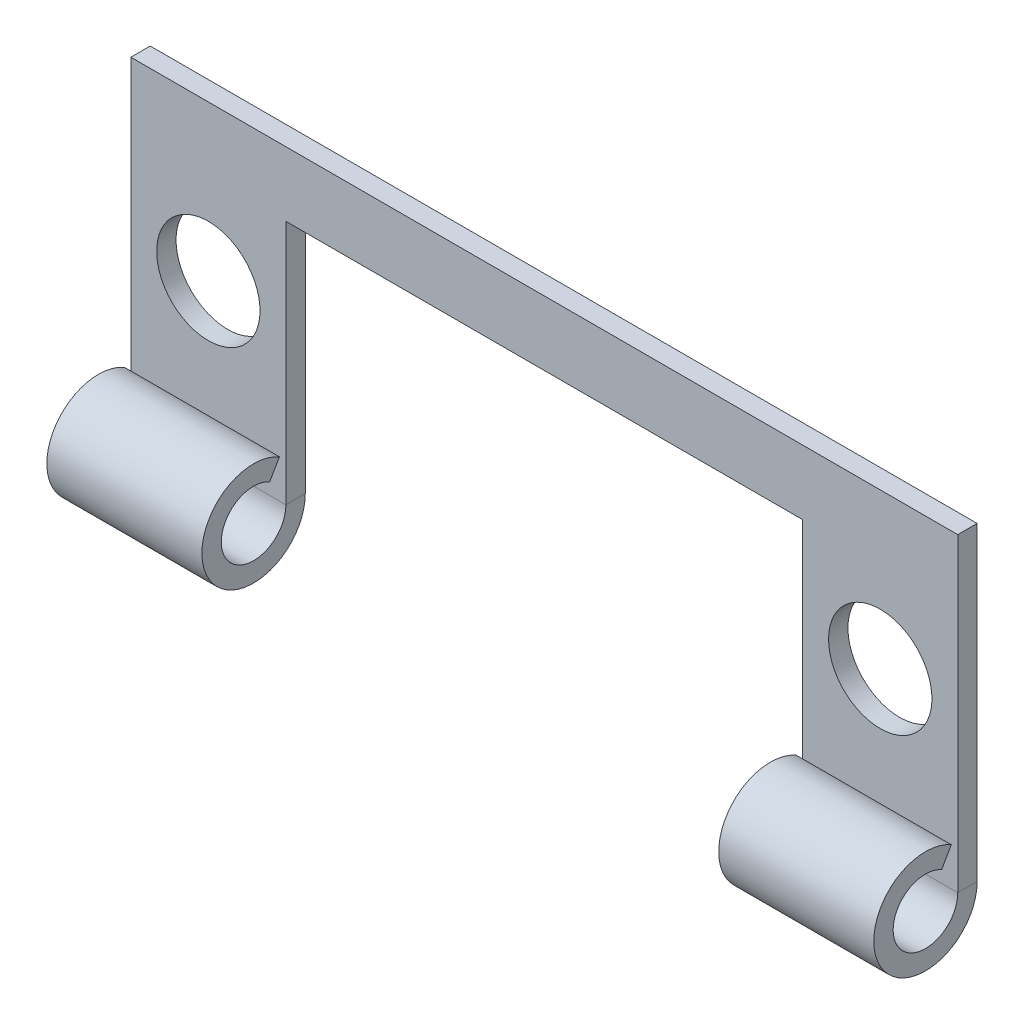
ISO-10303-21;
HEADER;
FILE_DESCRIPTION(('STEP AP214'),'2;1');
FILE_NAME('part.step','',(''),(''),'','','');
FILE_SCHEMA(('AUTOMOTIVE_DESIGN { 1 0 10303 214 1 1 1 1 }'));
ENDSEC;
DATA;
#1=APPLICATION_CONTEXT('core data for automotive mechanical design processes');
#2=APPLICATION_PROTOCOL_DEFINITION('international standard','automotive_design',2000,#1);
#3=PRODUCT_CONTEXT('',#1,'mechanical');
#4=PRODUCT('Part','Part','',(#3));
#5=PRODUCT_RELATED_PRODUCT_CATEGORY('part','',(#4));
#6=PRODUCT_DEFINITION_FORMATION('','',#4);
#7=PRODUCT_DEFINITION_CONTEXT('part definition',#1,'design');
#8=PRODUCT_DEFINITION('design','',#6,#7);
#9=PRODUCT_DEFINITION_SHAPE('','',#8);
#10=(LENGTH_UNIT() NAMED_UNIT(*) SI_UNIT(.MILLI.,.METRE.));
#11=(NAMED_UNIT(*) PLANE_ANGLE_UNIT() SI_UNIT($,.RADIAN.));
#12=(NAMED_UNIT(*) SI_UNIT($,.STERADIAN.) SOLID_ANGLE_UNIT());
#13=UNCERTAINTY_MEASURE_WITH_UNIT(LENGTH_MEASURE(1.E-05),#10,'distance_accuracy_value','');
#14=(GEOMETRIC_REPRESENTATION_CONTEXT(3) GLOBAL_UNCERTAINTY_ASSIGNED_CONTEXT((#13)) GLOBAL_UNIT_ASSIGNED_CONTEXT((#10,
#11,#12)) REPRESENTATION_CONTEXT('',''));
#15=CARTESIAN_POINT('',(0.,0.,0.));
#16=DIRECTION('',(0.,0.,1.));
#17=DIRECTION('',(1.,0.,0.));
#18=AXIS2_PLACEMENT_3D('',#15,#16,#17);
#19=CARTESIAN_POINT('',(0.,0.,-1.190625));
#20=DIRECTION('',(0.,0.,-1.));
#21=DIRECTION('',(-1.,0.,0.));
#22=AXIS2_PLACEMENT_3D('',#19,#20,#21);
#23=PLANE('',#22);
#24=CARTESIAN_POINT('',(-20.6375,0.,-1.190625));
#25=DIRECTION('',(0.,0.,1.));
#26=DIRECTION('',(1.,0.,0.));
#27=AXIS2_PLACEMENT_3D('',#24,#25,#26);
#28=CIRCLE('',#27,3.175);
#29=CARTESIAN_POINT('',(-17.4625,0.,-1.190625));
#30=VERTEX_POINT('',#29);
#31=EDGE_CURVE('E207',#30,#30,#28,.T.);
#32=ORIENTED_EDGE('',*,*,#31,.T.);
#33=EDGE_LOOP('',(#32));
#34=FACE_BOUND('',#33,.T.);
#35=CARTESIAN_POINT('',(20.6375,0.,-1.190625));
#36=DIRECTION('',(0.,0.,1.));
#37=DIRECTION('',(-1.,0.,0.));
#38=AXIS2_PLACEMENT_3D('',#35,#36,#37);
#39=CIRCLE('',#38,3.175);
#40=CARTESIAN_POINT('',(17.4625,0.,-1.190625));
#41=VERTEX_POINT('',#40);
#42=EDGE_CURVE('E216',#41,#41,#39,.T.);
#43=ORIENTED_EDGE('',*,*,#42,.T.);
#44=EDGE_LOOP('',(#43));
#45=FACE_BOUND('',#44,.T.);
#46=DIRECTION('',(1.,0.,0.));
#47=VECTOR('',#46,1.);
#48=CARTESIAN_POINT('',(-15.875,5.55625,-1.190625));
#49=LINE('',#48,#47);
#50=CARTESIAN_POINT('',(-15.875,5.55625,-1.190625));
#51=VERTEX_POINT('',#50);
#52=CARTESIAN_POINT('',(15.875,5.55625,-1.190625));
#53=VERTEX_POINT('',#52);
#54=EDGE_CURVE('E176',#51,#53,#49,.T.);
#55=ORIENTED_EDGE('',*,*,#54,.F.);
#56=DIRECTION('',(0.,1.,0.));
#57=VECTOR('',#56,1.);
#58=CARTESIAN_POINT('',(-15.875,-9.525,-1.190625));
#59=LINE('',#58,#57);
#60=CARTESIAN_POINT('',(-15.875,-9.525,-1.190625));
#61=VERTEX_POINT('',#60);
#62=EDGE_CURVE('E168',#61,#51,#59,.T.);
#63=ORIENTED_EDGE('',*,*,#62,.F.);
#64=DIRECTION('',(1.,0.,0.));
#65=VECTOR('',#64,1.);
#66=CARTESIAN_POINT('',(-25.4,-9.525,-1.190625));
#67=LINE('',#66,#65);
#68=CARTESIAN_POINT('',(-25.4,-9.525,-1.190625));
#69=VERTEX_POINT('',#68);
#70=EDGE_CURVE('E130',#69,#61,#67,.T.);
#71=ORIENTED_EDGE('',*,*,#70,.F.);
#72=DIRECTION('',(0.,-1.,0.));
#73=VECTOR('',#72,1.);
#74=CARTESIAN_POINT('',(-25.4,-9.525,-1.190625));
#75=LINE('',#74,#73);
#76=CARTESIAN_POINT('',(-25.4,9.525,-1.190625));
#77=VERTEX_POINT('',#76);
#78=EDGE_CURVE('E149',#77,#69,#75,.T.);
#79=ORIENTED_EDGE('',*,*,#78,.F.);
#80=DIRECTION('',(-1.,0.,0.));
#81=VECTOR('',#80,1.);
#82=CARTESIAN_POINT('',(-25.4,9.525,-1.190625));
#83=LINE('',#82,#81);
#84=CARTESIAN_POINT('',(25.4,9.525,-1.190625));
#85=VERTEX_POINT('',#84);
#86=EDGE_CURVE('E153',#85,#77,#83,.T.);
#87=ORIENTED_EDGE('',*,*,#86,.F.);
#88=DIRECTION('',(0.,1.,0.));
#89=VECTOR('',#88,1.);
#90=CARTESIAN_POINT('',(25.4,-9.525,-1.190625));
#91=LINE('',#90,#89);
#92=CARTESIAN_POINT('',(25.4,-9.525,-1.190625));
#93=VERTEX_POINT('',#92);
#94=EDGE_CURVE('E135',#93,#85,#91,.T.);
#95=ORIENTED_EDGE('',*,*,#94,.F.);
#96=CARTESIAN_POINT('',(15.875,-9.525,-1.190625));
#97=VERTEX_POINT('',#96);
#98=EDGE_CURVE('E141',#97,#93,#67,.T.);
#99=ORIENTED_EDGE('',*,*,#98,.F.);
#100=DIRECTION('',(0.,1.,0.));
#101=VECTOR('',#100,1.);
#102=CARTESIAN_POINT('',(15.875,-9.525,-1.190625));
#103=LINE('',#102,#101);
#104=EDGE_CURVE('E166',#97,#53,#103,.T.);
#105=ORIENTED_EDGE('',*,*,#104,.T.);
#106=EDGE_LOOP('',(#55,#63,#71,#79,#87,#95,#99,#105));
#107=FACE_BOUND('',#106,.T.);
#108=ADVANCED_FACE('F41',(#34,#45,#107),#23,.T.);
#109=CARTESIAN_POINT('',(0.,0.,0.));
#110=DIRECTION('',(0.,0.,-1.));
#111=DIRECTION('',(-1.,0.,0.));
#112=AXIS2_PLACEMENT_3D('',#109,#110,#111);
#113=PLANE('',#112);
#114=CARTESIAN_POINT('',(-20.6375,0.,0.));
#115=DIRECTION('',(0.,0.,1.));
#116=DIRECTION('',(1.,0.,0.));
#117=AXIS2_PLACEMENT_3D('',#114,#115,#116);
#118=CIRCLE('',#117,3.175);
#119=CARTESIAN_POINT('',(-17.4625,0.,0.));
#120=VERTEX_POINT('',#119);
#121=EDGE_CURVE('E222',#120,#120,#118,.T.);
#122=ORIENTED_EDGE('',*,*,#121,.F.);
#123=EDGE_LOOP('',(#122));
#124=FACE_BOUND('',#123,.T.);
#125=CARTESIAN_POINT('',(20.6375,0.,0.));
#126=DIRECTION('',(0.,0.,1.));
#127=DIRECTION('',(-1.,0.,0.));
#128=AXIS2_PLACEMENT_3D('',#125,#126,#127);
#129=CIRCLE('',#128,3.175);
#130=CARTESIAN_POINT('',(17.4625,0.,0.));
#131=VERTEX_POINT('',#130);
#132=EDGE_CURVE('E219',#131,#131,#129,.T.);
#133=ORIENTED_EDGE('',*,*,#132,.F.);
#134=EDGE_LOOP('',(#133));
#135=FACE_BOUND('',#134,.T.);
#136=DIRECTION('',(0.,1.,0.));
#137=VECTOR('',#136,1.);
#138=CARTESIAN_POINT('',(-15.875,-9.525,0.));
#139=LINE('',#138,#137);
#140=CARTESIAN_POINT('',(-15.875,-9.525,0.));
#141=VERTEX_POINT('',#140);
#142=CARTESIAN_POINT('',(-15.875,5.55625,0.));
#143=VERTEX_POINT('',#142);
#144=EDGE_CURVE('E171',#141,#143,#139,.T.);
#145=ORIENTED_EDGE('',*,*,#144,.T.);
#146=DIRECTION('',(1.,0.,0.));
#147=VECTOR('',#146,1.);
#148=CARTESIAN_POINT('',(-15.875,5.55625,0.));
#149=LINE('',#148,#147);
#150=CARTESIAN_POINT('',(15.875,5.55625,0.));
#151=VERTEX_POINT('',#150);
#152=EDGE_CURVE('E169',#143,#151,#149,.T.);
#153=ORIENTED_EDGE('',*,*,#152,.T.);
#154=DIRECTION('',(0.,1.,0.));
#155=VECTOR('',#154,1.);
#156=CARTESIAN_POINT('',(15.875,-9.525,0.));
#157=LINE('',#156,#155);
#158=CARTESIAN_POINT('',(15.875,-9.525,0.));
#159=VERTEX_POINT('',#158);
#160=EDGE_CURVE('E117',#159,#151,#157,.T.);
#161=ORIENTED_EDGE('',*,*,#160,.F.);
#162=DIRECTION('',(1.,0.,0.));
#163=VECTOR('',#162,1.);
#164=CARTESIAN_POINT('',(-25.4,-9.525,0.));
#165=LINE('',#164,#163);
#166=CARTESIAN_POINT('',(25.4,-9.525,0.));
#167=VERTEX_POINT('',#166);
#168=EDGE_CURVE('E89',#159,#167,#165,.T.);
#169=ORIENTED_EDGE('',*,*,#168,.T.);
#170=DIRECTION('',(0.,1.,0.));
#171=VECTOR('',#170,1.);
#172=CARTESIAN_POINT('',(25.4,-9.525,0.));
#173=LINE('',#172,#171);
#174=CARTESIAN_POINT('',(25.4,9.525,0.));
#175=VERTEX_POINT('',#174);
#176=EDGE_CURVE('E114',#167,#175,#173,.T.);
#177=ORIENTED_EDGE('',*,*,#176,.T.);
#178=DIRECTION('',(-1.,0.,0.));
#179=VECTOR('',#178,1.);
#180=CARTESIAN_POINT('',(-25.4,9.525,0.));
#181=LINE('',#180,#179);
#182=CARTESIAN_POINT('',(-25.4,9.525,0.));
#183=VERTEX_POINT('',#182);
#184=EDGE_CURVE('E122',#175,#183,#181,.T.);
#185=ORIENTED_EDGE('',*,*,#184,.T.);
#186=DIRECTION('',(0.,-1.,0.));
#187=VECTOR('',#186,1.);
#188=CARTESIAN_POINT('',(-25.4,-9.525,0.));
#189=LINE('',#188,#187);
#190=CARTESIAN_POINT('',(-25.4,-9.525,0.));
#191=VERTEX_POINT('',#190);
#192=EDGE_CURVE('E119',#183,#191,#189,.T.);
#193=ORIENTED_EDGE('',*,*,#192,.T.);
#194=EDGE_CURVE('E118',#191,#141,#165,.T.);
#195=ORIENTED_EDGE('',*,*,#194,.T.);
#196=EDGE_LOOP('',(#145,#153,#161,#169,#177,#185,#193,#195));
#197=FACE_BOUND('',#196,.T.);
#198=ADVANCED_FACE('F112',(#124,#135,#197),#113,.F.);
#199=CARTESIAN_POINT('',(25.4,-9.525,-1.190625));
#200=DIRECTION('',(1.,0.,0.));
#201=DIRECTION('',(0.,0.,-1.));
#202=AXIS2_PLACEMENT_3D('',#199,#200,#201);
#203=PLANE('',#202);
#204=ORIENTED_EDGE('',*,*,#176,.F.);
#205=DIRECTION('',(0.,0.,1.));
#206=VECTOR('',#205,1.);
#207=CARTESIAN_POINT('',(25.4,-9.525,-1.190625));
#208=LINE('',#207,#206);
#209=EDGE_CURVE('E11',#93,#167,#208,.T.);
#210=ORIENTED_EDGE('',*,*,#209,.F.);
#211=ORIENTED_EDGE('',*,*,#94,.T.);
#212=DIRECTION('',(0.,0.,1.));
#213=VECTOR('',#212,1.);
#214=CARTESIAN_POINT('',(25.4,9.525,-1.190625));
#215=LINE('',#214,#213);
#216=EDGE_CURVE('E45',#85,#175,#215,.T.);
#217=ORIENTED_EDGE('',*,*,#216,.T.);
#218=EDGE_LOOP('',(#204,#210,#211,#217));
#219=FACE_BOUND('',#218,.T.);
#220=ADVANCED_FACE('F43',(#219),#203,.T.);
#221=CARTESIAN_POINT('',(-25.4,-9.525,-1.190625));
#222=DIRECTION('',(-1.,0.,0.));
#223=DIRECTION('',(0.,0.,1.));
#224=AXIS2_PLACEMENT_3D('',#221,#222,#223);
#225=PLANE('',#224);
#226=ORIENTED_EDGE('',*,*,#192,.F.);
#227=DIRECTION('',(0.,0.,1.));
#228=VECTOR('',#227,1.);
#229=CARTESIAN_POINT('',(-25.4,9.525,-1.190625));
#230=LINE('',#229,#228);
#231=EDGE_CURVE('E60',#77,#183,#230,.T.);
#232=ORIENTED_EDGE('',*,*,#231,.F.);
#233=ORIENTED_EDGE('',*,*,#78,.T.);
#234=DIRECTION('',(0.,0.,1.));
#235=VECTOR('',#234,1.);
#236=CARTESIAN_POINT('',(-25.4,-9.525,-1.190625));
#237=LINE('',#236,#235);
#238=EDGE_CURVE('E51',#69,#191,#237,.T.);
#239=ORIENTED_EDGE('',*,*,#238,.T.);
#240=EDGE_LOOP('',(#226,#232,#233,#239));
#241=FACE_BOUND('',#240,.T.);
#242=ADVANCED_FACE('F260',(#241),#225,.T.);
#243=CARTESIAN_POINT('',(-25.4,9.525,-1.190625));
#244=DIRECTION('',(0.,1.,0.));
#245=DIRECTION('',(0.,0.,1.));
#246=AXIS2_PLACEMENT_3D('',#243,#244,#245);
#247=PLANE('',#246);
#248=ORIENTED_EDGE('',*,*,#184,.F.);
#249=ORIENTED_EDGE('',*,*,#216,.F.);
#250=ORIENTED_EDGE('',*,*,#86,.T.);
#251=ORIENTED_EDGE('',*,*,#231,.T.);
#252=EDGE_LOOP('',(#248,#249,#250,#251));
#253=FACE_BOUND('',#252,.T.);
#254=ADVANCED_FACE('F262',(#253),#247,.T.);
#255=CARTESIAN_POINT('',(-15.875,-9.525,-1.190625));
#256=DIRECTION('',(1.,0.,0.));
#257=DIRECTION('',(0.,0.,-1.));
#258=AXIS2_PLACEMENT_3D('',#255,#256,#257);
#259=PLANE('',#258);
#260=ORIENTED_EDGE('',*,*,#144,.F.);
#261=DIRECTION('',(0.,0.,1.));
#262=VECTOR('',#261,1.);
#263=CARTESIAN_POINT('',(-15.875,-9.525,-1.190625));
#264=LINE('',#263,#262);
#265=EDGE_CURVE('E163',#61,#141,#264,.T.);
#266=ORIENTED_EDGE('',*,*,#265,.F.);
#267=ORIENTED_EDGE('',*,*,#62,.T.);
#268=DIRECTION('',(0.,0.,1.));
#269=VECTOR('',#268,1.);
#270=CARTESIAN_POINT('',(-15.875,5.55625,-1.190625));
#271=LINE('',#270,#269);
#272=EDGE_CURVE('E123',#51,#143,#271,.T.);
#273=ORIENTED_EDGE('',*,*,#272,.T.);
#274=EDGE_LOOP('',(#260,#266,#267,#273));
#275=FACE_BOUND('',#274,.T.);
#276=ADVANCED_FACE('F257',(#275),#259,.T.);
#277=CARTESIAN_POINT('',(-15.875,5.55625,-1.190625));
#278=DIRECTION('',(0.,-1.,0.));
#279=DIRECTION('',(1.,0.,0.));
#280=AXIS2_PLACEMENT_3D('',#277,#278,#279);
#281=PLANE('',#280);
#282=ORIENTED_EDGE('',*,*,#152,.F.);
#283=ORIENTED_EDGE('',*,*,#272,.F.);
#284=ORIENTED_EDGE('',*,*,#54,.T.);
#285=DIRECTION('',(0.,0.,1.));
#286=VECTOR('',#285,1.);
#287=CARTESIAN_POINT('',(15.875,5.55625,-1.190625));
#288=LINE('',#287,#286);
#289=EDGE_CURVE('E127',#53,#151,#288,.T.);
#290=ORIENTED_EDGE('',*,*,#289,.T.);
#291=EDGE_LOOP('',(#282,#283,#284,#290));
#292=FACE_BOUND('',#291,.T.);
#293=ADVANCED_FACE('F267',(#292),#281,.T.);
#294=CARTESIAN_POINT('',(15.875,-9.525,-1.190625));
#295=DIRECTION('',(1.,0.,0.));
#296=DIRECTION('',(0.,1.,0.));
#297=AXIS2_PLACEMENT_3D('',#294,#295,#296);
#298=PLANE('',#297);
#299=ORIENTED_EDGE('',*,*,#160,.T.);
#300=ORIENTED_EDGE('',*,*,#289,.F.);
#301=ORIENTED_EDGE('',*,*,#104,.F.);
#302=DIRECTION('',(0.,0.,1.));
#303=VECTOR('',#302,1.);
#304=CARTESIAN_POINT('',(15.875,-9.525,-1.190625));
#305=LINE('',#304,#303);
#306=EDGE_CURVE('E160',#97,#159,#305,.T.);
#307=ORIENTED_EDGE('',*,*,#306,.T.);
#308=EDGE_LOOP('',(#299,#300,#301,#307));
#309=FACE_BOUND('',#308,.T.);
#310=ADVANCED_FACE('F305',(#309),#298,.F.);
#311=CARTESIAN_POINT('',(-20.6375,-7.80648083936527,0.992187499999979));
#312=DIRECTION('',(0.,0.500000000000011,0.866025403784433));
#313=DIRECTION('',(1.,0.,0.));
#314=AXIS2_PLACEMENT_3D('',#311,#312,#313);
#315=PLANE('',#314);
#316=DIRECTION('',(0.,0.866025403784433,-0.500000000000011));
#317=VECTOR('',#316,1.);
#318=CARTESIAN_POINT('',(-15.875,-7.80648083936527,0.992187499999979));
#319=LINE('',#318,#317);
#320=CARTESIAN_POINT('',(-15.875,-7.80648083936527,0.992187499999979));
#321=VERTEX_POINT('',#320);
#322=CARTESIAN_POINT('',(-15.875,-6.77536934298443,0.396874999999967));
#323=VERTEX_POINT('',#322);
#324=EDGE_CURVE('E173',#321,#323,#319,.T.);
#325=ORIENTED_EDGE('',*,*,#324,.F.);
#326=DIRECTION('',(1.,0.,0.));
#327=VECTOR('',#326,1.);
#328=CARTESIAN_POINT('',(-15.875,-7.80648083936527,0.992187499999979));
#329=LINE('',#328,#327);
#330=CARTESIAN_POINT('',(-25.4,-7.80648083936527,0.992187499999979));
#331=VERTEX_POINT('',#330);
#332=EDGE_CURVE('E187',#331,#321,#329,.T.);
#333=ORIENTED_EDGE('',*,*,#332,.F.);
#334=DIRECTION('',(0.,0.866025403784433,-0.500000000000011));
#335=VECTOR('',#334,1.);
#336=CARTESIAN_POINT('',(-25.4,-7.80648083936527,0.992187499999979));
#337=LINE('',#336,#335);
#338=CARTESIAN_POINT('',(-25.4,-6.77536934298443,0.396874999999967));
#339=VERTEX_POINT('',#338);
#340=EDGE_CURVE('E183',#331,#339,#337,.T.);
#341=ORIENTED_EDGE('',*,*,#340,.T.);
#342=DIRECTION('',(1.,0.,0.));
#343=VECTOR('',#342,1.);
#344=CARTESIAN_POINT('',(-15.875,-6.77536934298443,0.396874999999967));
#345=LINE('',#344,#343);
#346=EDGE_CURVE('E195',#339,#323,#345,.T.);
#347=ORIENTED_EDGE('',*,*,#346,.T.);
#348=EDGE_LOOP('',(#325,#333,#341,#347));
#349=FACE_BOUND('',#348,.T.);
#350=ADVANCED_FACE('F281',(#349),#315,.F.);
#351=CARTESIAN_POINT('',(-25.4,-9.525,1.984375));
#352=DIRECTION('',(-1.,0.,0.));
#353=DIRECTION('',(0.,0.,1.));
#354=AXIS2_PLACEMENT_3D('',#351,#352,#353);
#355=PLANE('',#354);
#356=ORIENTED_EDGE('',*,*,#340,.F.);
#357=CARTESIAN_POINT('',(-25.4,-9.525,1.984375));
#358=DIRECTION('',(1.,0.,0.));
#359=DIRECTION('',(0.,0.,-1.));
#360=AXIS2_PLACEMENT_3D('',#357,#358,#359);
#361=CIRCLE('',#360,1.984375);
#362=EDGE_CURVE('E77',#191,#331,#361,.F.);
#363=ORIENTED_EDGE('',*,*,#362,.F.);
#364=ORIENTED_EDGE('',*,*,#238,.F.);
#365=CARTESIAN_POINT('',(-25.4,-9.525,1.984375));
#366=DIRECTION('',(1.,0.,0.));
#367=DIRECTION('',(0.,0.,-1.));
#368=AXIS2_PLACEMENT_3D('',#365,#366,#367);
#369=CIRCLE('',#368,3.175);
#370=EDGE_CURVE('E186',#69,#339,#369,.F.);
#371=ORIENTED_EDGE('',*,*,#370,.T.);
#372=EDGE_LOOP('',(#356,#363,#364,#371));
#373=FACE_BOUND('',#372,.T.);
#374=ADVANCED_FACE('F271',(#373),#355,.T.);
#375=CARTESIAN_POINT('',(-15.875,-9.525,1.984375));
#376=DIRECTION('',(-1.,0.,0.));
#377=DIRECTION('',(0.,0.,1.));
#378=AXIS2_PLACEMENT_3D('',#375,#376,#377);
#379=PLANE('',#378);
#380=CARTESIAN_POINT('',(-15.875,-9.525,1.984375));
#381=DIRECTION('',(1.,0.,0.));
#382=DIRECTION('',(0.,0.,-1.));
#383=AXIS2_PLACEMENT_3D('',#380,#381,#382);
#384=CIRCLE('',#383,1.984375);
#385=EDGE_CURVE('E190',#321,#141,#384,.T.);
#386=ORIENTED_EDGE('',*,*,#385,.F.);
#387=ORIENTED_EDGE('',*,*,#324,.T.);
#388=CARTESIAN_POINT('',(-15.875,-9.525,1.984375));
#389=DIRECTION('',(1.,0.,0.));
#390=DIRECTION('',(0.,0.,-1.));
#391=AXIS2_PLACEMENT_3D('',#388,#389,#390);
#392=CIRCLE('',#391,3.175);
#393=EDGE_CURVE('E196',#323,#61,#392,.T.);
#394=ORIENTED_EDGE('',*,*,#393,.T.);
#395=ORIENTED_EDGE('',*,*,#265,.T.);
#396=EDGE_LOOP('',(#386,#387,#394,#395));
#397=FACE_BOUND('',#396,.T.);
#398=ADVANCED_FACE('F340',(#397),#379,.F.);
#399=CARTESIAN_POINT('',(-15.875,-9.525,1.984375));
#400=DIRECTION('',(1.,0.,0.));
#401=DIRECTION('',(0.,0.866025403784433,-0.50000000000001));
#402=AXIS2_PLACEMENT_3D('',#399,#400,#401);
#403=CYLINDRICAL_SURFACE('',#402,3.175);
#404=ORIENTED_EDGE('',*,*,#70,.T.);
#405=ORIENTED_EDGE('',*,*,#393,.F.);
#406=ORIENTED_EDGE('',*,*,#346,.F.);
#407=ORIENTED_EDGE('',*,*,#370,.F.);
#408=EDGE_LOOP('',(#404,#405,#406,#407));
#409=FACE_BOUND('',#408,.T.);
#410=ADVANCED_FACE('F276',(#409),#403,.T.);
#411=CARTESIAN_POINT('',(-15.875,-9.525,1.984375));
#412=DIRECTION('',(1.,0.,0.));
#413=DIRECTION('',(0.,0.866025403784433,-0.50000000000001));
#414=AXIS2_PLACEMENT_3D('',#411,#412,#413);
#415=CYLINDRICAL_SURFACE('',#414,1.984375);
#416=ORIENTED_EDGE('',*,*,#194,.F.);
#417=ORIENTED_EDGE('',*,*,#362,.T.);
#418=ORIENTED_EDGE('',*,*,#332,.T.);
#419=ORIENTED_EDGE('',*,*,#385,.T.);
#420=EDGE_LOOP('',(#416,#417,#418,#419));
#421=FACE_BOUND('',#420,.T.);
#422=ADVANCED_FACE('F335',(#421),#415,.F.);
#423=CARTESIAN_POINT('',(20.6375,-7.80648083936527,0.992187499999979));
#424=DIRECTION('',(0.,0.500000000000011,0.866025403784433));
#425=DIRECTION('',(1.,0.,0.));
#426=AXIS2_PLACEMENT_3D('',#423,#424,#425);
#427=PLANE('',#426);
#428=DIRECTION('',(0.,0.866025403784433,-0.500000000000011));
#429=VECTOR('',#428,1.);
#430=CARTESIAN_POINT('',(25.4,-7.80648083936527,0.992187499999979));
#431=LINE('',#430,#429);
#432=CARTESIAN_POINT('',(25.4,-7.80648083936527,0.992187499999979));
#433=VERTEX_POINT('',#432);
#434=CARTESIAN_POINT('',(25.4,-6.77536934298443,0.396874999999967));
#435=VERTEX_POINT('',#434);
#436=EDGE_CURVE('E191',#433,#435,#431,.T.);
#437=ORIENTED_EDGE('',*,*,#436,.F.);
#438=DIRECTION('',(1.,0.,0.));
#439=VECTOR('',#438,1.);
#440=CARTESIAN_POINT('',(25.4,-7.80648083936527,0.992187499999979));
#441=LINE('',#440,#439);
#442=CARTESIAN_POINT('',(15.875,-7.80648083936527,0.992187499999979));
#443=VERTEX_POINT('',#442);
#444=EDGE_CURVE('E93',#443,#433,#441,.T.);
#445=ORIENTED_EDGE('',*,*,#444,.F.);
#446=DIRECTION('',(0.,0.866025403784433,-0.500000000000011));
#447=VECTOR('',#446,1.);
#448=CARTESIAN_POINT('',(15.875,-7.80648083936527,0.992187499999979));
#449=LINE('',#448,#447);
#450=CARTESIAN_POINT('',(15.875,-6.77536934298443,0.396874999999967));
#451=VERTEX_POINT('',#450);
#452=EDGE_CURVE('E203',#443,#451,#449,.T.);
#453=ORIENTED_EDGE('',*,*,#452,.T.);
#454=DIRECTION('',(1.,0.,0.));
#455=VECTOR('',#454,1.);
#456=CARTESIAN_POINT('',(25.4,-6.77536934298443,0.396874999999967));
#457=LINE('',#456,#455);
#458=EDGE_CURVE('E210',#451,#435,#457,.T.);
#459=ORIENTED_EDGE('',*,*,#458,.T.);
#460=EDGE_LOOP('',(#437,#445,#453,#459));
#461=FACE_BOUND('',#460,.T.);
#462=ADVANCED_FACE('F325',(#461),#427,.F.);
#463=CARTESIAN_POINT('',(15.875,-9.525,1.984375));
#464=DIRECTION('',(-1.,0.,0.));
#465=DIRECTION('',(0.,0.,1.));
#466=AXIS2_PLACEMENT_3D('',#463,#464,#465);
#467=PLANE('',#466);
#468=ORIENTED_EDGE('',*,*,#452,.F.);
#469=CARTESIAN_POINT('',(15.875,-9.525,1.984375));
#470=DIRECTION('',(1.,0.,0.));
#471=DIRECTION('',(0.,0.,-1.));
#472=AXIS2_PLACEMENT_3D('',#469,#470,#471);
#473=CIRCLE('',#472,1.984375);
#474=EDGE_CURVE('E96',#159,#443,#473,.F.);
#475=ORIENTED_EDGE('',*,*,#474,.F.);
#476=ORIENTED_EDGE('',*,*,#306,.F.);
#477=CARTESIAN_POINT('',(15.875,-9.525,1.984375));
#478=DIRECTION('',(1.,0.,0.));
#479=DIRECTION('',(0.,0.,-1.));
#480=AXIS2_PLACEMENT_3D('',#477,#478,#479);
#481=CIRCLE('',#480,3.175);
#482=EDGE_CURVE('E206',#97,#451,#481,.F.);
#483=ORIENTED_EDGE('',*,*,#482,.T.);
#484=EDGE_LOOP('',(#468,#475,#476,#483));
#485=FACE_BOUND('',#484,.T.);
#486=ADVANCED_FACE('F327',(#485),#467,.T.);
#487=CARTESIAN_POINT('',(25.4,-9.525,1.984375));
#488=DIRECTION('',(-1.,0.,0.));
#489=DIRECTION('',(0.,0.,1.));
#490=AXIS2_PLACEMENT_3D('',#487,#488,#489);
#491=PLANE('',#490);
#492=CARTESIAN_POINT('',(25.4,-9.525,1.984375));
#493=DIRECTION('',(1.,0.,0.));
#494=DIRECTION('',(0.,0.,-1.));
#495=AXIS2_PLACEMENT_3D('',#492,#493,#494);
#496=CIRCLE('',#495,1.984375);
#497=EDGE_CURVE('E84',#433,#167,#496,.T.);
#498=ORIENTED_EDGE('',*,*,#497,.F.);
#499=ORIENTED_EDGE('',*,*,#436,.T.);
#500=CARTESIAN_POINT('',(25.4,-9.525,1.984375));
#501=DIRECTION('',(1.,0.,0.));
#502=DIRECTION('',(0.,0.,-1.));
#503=AXIS2_PLACEMENT_3D('',#500,#501,#502);
#504=CIRCLE('',#503,3.175);
#505=EDGE_CURVE('E103',#435,#93,#504,.T.);
#506=ORIENTED_EDGE('',*,*,#505,.T.);
#507=ORIENTED_EDGE('',*,*,#209,.T.);
#508=EDGE_LOOP('',(#498,#499,#506,#507));
#509=FACE_BOUND('',#508,.T.);
#510=ADVANCED_FACE('F100',(#509),#491,.F.);
#511=CARTESIAN_POINT('',(25.4,-9.525,1.984375));
#512=DIRECTION('',(1.,0.,0.));
#513=DIRECTION('',(0.,0.866025403784433,-0.50000000000001));
#514=AXIS2_PLACEMENT_3D('',#511,#512,#513);
#515=CYLINDRICAL_SURFACE('',#514,3.175);
#516=ORIENTED_EDGE('',*,*,#98,.T.);
#517=ORIENTED_EDGE('',*,*,#505,.F.);
#518=ORIENTED_EDGE('',*,*,#458,.F.);
#519=ORIENTED_EDGE('',*,*,#482,.F.);
#520=EDGE_LOOP('',(#516,#517,#518,#519));
#521=FACE_BOUND('',#520,.T.);
#522=ADVANCED_FACE('F248',(#521),#515,.T.);
#523=CARTESIAN_POINT('',(25.4,-9.525,1.984375));
#524=DIRECTION('',(1.,0.,0.));
#525=DIRECTION('',(0.,0.866025403784433,-0.50000000000001));
#526=AXIS2_PLACEMENT_3D('',#523,#524,#525);
#527=CYLINDRICAL_SURFACE('',#526,1.984375);
#528=ORIENTED_EDGE('',*,*,#168,.F.);
#529=ORIENTED_EDGE('',*,*,#474,.T.);
#530=ORIENTED_EDGE('',*,*,#444,.T.);
#531=ORIENTED_EDGE('',*,*,#497,.T.);
#532=EDGE_LOOP('',(#528,#529,#530,#531));
#533=FACE_BOUND('',#532,.T.);
#534=ADVANCED_FACE('F85',(#533),#527,.F.);
#535=CARTESIAN_POINT('',(20.6375,0.,-1.190625));
#536=DIRECTION('',(0.,0.,1.));
#537=DIRECTION('',(1.,0.,0.));
#538=AXIS2_PLACEMENT_3D('',#535,#536,#537);
#539=CYLINDRICAL_SURFACE('',#538,3.175);
#540=ORIENTED_EDGE('',*,*,#42,.F.);
#541=EDGE_LOOP('',(#540));
#542=FACE_BOUND('',#541,.T.);
#543=ORIENTED_EDGE('',*,*,#132,.T.);
#544=EDGE_LOOP('',(#543));
#545=FACE_BOUND('',#544,.T.);
#546=ADVANCED_FACE('F233',(#542,#545),#539,.F.);
#547=CARTESIAN_POINT('',(-20.6375,0.,-1.190625));
#548=DIRECTION('',(0.,0.,1.));
#549=DIRECTION('',(1.,0.,0.));
#550=AXIS2_PLACEMENT_3D('',#547,#548,#549);
#551=CYLINDRICAL_SURFACE('',#550,3.175);
#552=ORIENTED_EDGE('',*,*,#31,.F.);
#553=EDGE_LOOP('',(#552));
#554=FACE_BOUND('',#553,.T.);
#555=ORIENTED_EDGE('',*,*,#121,.T.);
#556=EDGE_LOOP('',(#555));
#557=FACE_BOUND('',#556,.T.);
#558=ADVANCED_FACE('F230',(#554,#557),#551,.F.);
#559=CLOSED_SHELL('',(#108,#198,#220,#242,#254,#276,#293,#310,#350,#374,#398,#410,#422,#462,
#486,#510,#522,#534,#546,#558));
#560=MANIFOLD_SOLID_BREP('B2',#559);
#561=ADVANCED_BREP_SHAPE_REPRESENTATION('',(#18,#560),#14);
#562=SHAPE_DEFINITION_REPRESENTATION(#9,#561);
ENDSEC;
END-ISO-10303-21;
